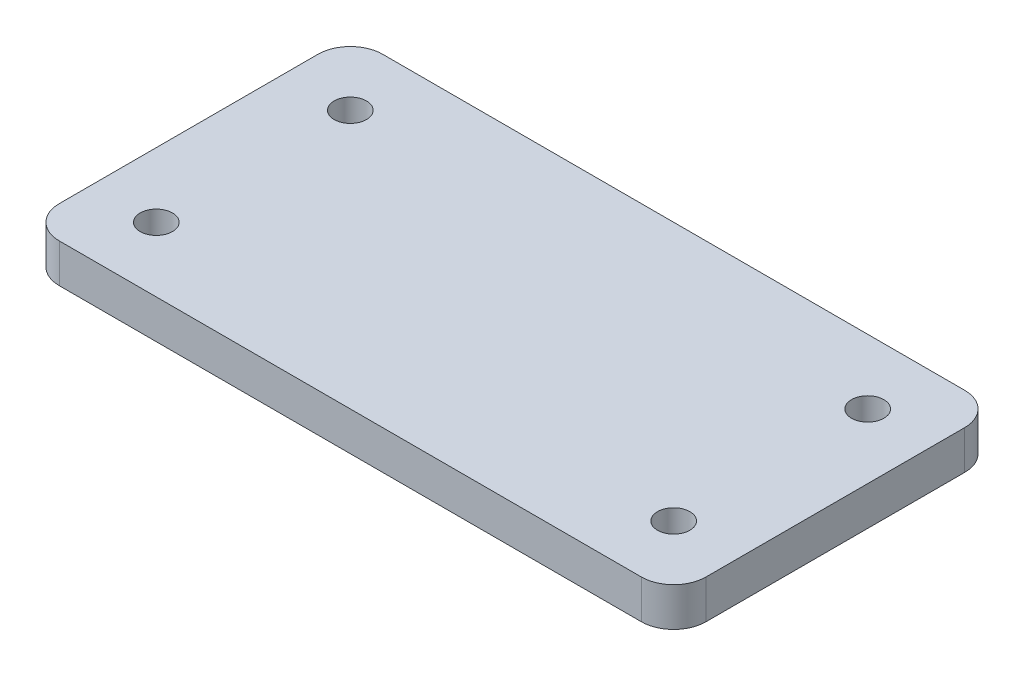
ISO-10303-21;
HEADER;
FILE_DESCRIPTION(('STEP AP214'),'2;1');
FILE_NAME('part.step','',(''),(''),'','','');
FILE_SCHEMA(('AUTOMOTIVE_DESIGN { 1 0 10303 214 1 1 1 1 }'));
ENDSEC;
DATA;
#1=APPLICATION_CONTEXT('core data for automotive mechanical design processes');
#2=APPLICATION_PROTOCOL_DEFINITION('international standard','automotive_design',2000,#1);
#3=PRODUCT_CONTEXT('',#1,'mechanical');
#4=PRODUCT('Part','Part','',(#3));
#5=PRODUCT_RELATED_PRODUCT_CATEGORY('part','',(#4));
#6=PRODUCT_DEFINITION_FORMATION('','',#4);
#7=PRODUCT_DEFINITION_CONTEXT('part definition',#1,'design');
#8=PRODUCT_DEFINITION('design','',#6,#7);
#9=PRODUCT_DEFINITION_SHAPE('','',#8);
#10=(LENGTH_UNIT() NAMED_UNIT(*) SI_UNIT(.MILLI.,.METRE.));
#11=(NAMED_UNIT(*) PLANE_ANGLE_UNIT() SI_UNIT($,.RADIAN.));
#12=(NAMED_UNIT(*) SI_UNIT($,.STERADIAN.) SOLID_ANGLE_UNIT());
#13=UNCERTAINTY_MEASURE_WITH_UNIT(LENGTH_MEASURE(1.E-05),#10,'distance_accuracy_value','');
#14=(GEOMETRIC_REPRESENTATION_CONTEXT(3) GLOBAL_UNCERTAINTY_ASSIGNED_CONTEXT((#13)) GLOBAL_UNIT_ASSIGNED_CONTEXT((#10,
#11,#12)) REPRESENTATION_CONTEXT('',''));
#15=CARTESIAN_POINT('',(0.,0.,0.));
#16=DIRECTION('',(0.,0.,1.));
#17=DIRECTION('',(1.,0.,0.));
#18=AXIS2_PLACEMENT_3D('',#15,#16,#17);
#19=CARTESIAN_POINT('',(90.,12.,40.));
#20=DIRECTION('',(0.,1.,0.));
#21=DIRECTION('',(0.,0.,1.));
#22=AXIS2_PLACEMENT_3D('',#19,#20,#21);
#23=PLANE('',#22);
#24=CARTESIAN_POINT('',(80.,12.,-30.));
#25=DIRECTION('',(0.,1.,0.));
#26=DIRECTION('',(0.,0.,1.));
#27=AXIS2_PLACEMENT_3D('',#24,#25,#26);
#28=CIRCLE('',#27,5.);
#29=CARTESIAN_POINT('',(80.,12.,-25.));
#30=VERTEX_POINT('',#29);
#31=EDGE_CURVE('E188',#30,#30,#28,.T.);
#32=ORIENTED_EDGE('',*,*,#31,.F.);
#33=EDGE_LOOP('',(#32));
#34=FACE_BOUND('',#33,.T.);
#35=CARTESIAN_POINT('',(-80.,12.,30.));
#36=DIRECTION('',(0.,1.,0.));
#37=DIRECTION('',(0.,0.,1.));
#38=AXIS2_PLACEMENT_3D('',#35,#36,#37);
#39=CIRCLE('',#38,4.99999999999999);
#40=CARTESIAN_POINT('',(-80.,12.,35.));
#41=VERTEX_POINT('',#40);
#42=EDGE_CURVE('E134',#41,#41,#39,.T.);
#43=ORIENTED_EDGE('',*,*,#42,.F.);
#44=EDGE_LOOP('',(#43));
#45=FACE_BOUND('',#44,.T.);
#46=CARTESIAN_POINT('',(90.,12.,40.));
#47=DIRECTION('',(0.,1.,0.));
#48=DIRECTION('',(0.,0.,1.));
#49=AXIS2_PLACEMENT_3D('',#46,#47,#48);
#50=CIRCLE('',#49,10.);
#51=CARTESIAN_POINT('',(90.,12.,50.));
#52=VERTEX_POINT('',#51);
#53=CARTESIAN_POINT('',(100.,12.,40.));
#54=VERTEX_POINT('',#53);
#55=EDGE_CURVE('E145',#52,#54,#50,.T.);
#56=ORIENTED_EDGE('',*,*,#55,.T.);
#57=DIRECTION('',(0.,0.,-1.));
#58=VECTOR('',#57,1.);
#59=CARTESIAN_POINT('',(100.,12.,40.));
#60=LINE('',#59,#58);
#61=CARTESIAN_POINT('',(100.,12.,-40.));
#62=VERTEX_POINT('',#61);
#63=EDGE_CURVE('E93',#54,#62,#60,.T.);
#64=ORIENTED_EDGE('',*,*,#63,.T.);
#65=CARTESIAN_POINT('',(90.,12.,-40.));
#66=DIRECTION('',(0.,1.,0.));
#67=DIRECTION('',(0.,0.,-1.));
#68=AXIS2_PLACEMENT_3D('',#65,#66,#67);
#69=CIRCLE('',#68,9.99999999999998);
#70=CARTESIAN_POINT('',(90.,12.,-50.));
#71=VERTEX_POINT('',#70);
#72=EDGE_CURVE('E160',#62,#71,#69,.T.);
#73=ORIENTED_EDGE('',*,*,#72,.T.);
#74=DIRECTION('',(-1.,0.,0.));
#75=VECTOR('',#74,1.);
#76=CARTESIAN_POINT('',(-90.,12.,-50.));
#77=LINE('',#76,#75);
#78=CARTESIAN_POINT('',(-90.,12.,-50.));
#79=VERTEX_POINT('',#78);
#80=EDGE_CURVE('E173',#71,#79,#77,.T.);
#81=ORIENTED_EDGE('',*,*,#80,.T.);
#82=CARTESIAN_POINT('',(-90.,12.,-40.));
#83=DIRECTION('',(0.,1.,0.));
#84=DIRECTION('',(0.,0.,-1.));
#85=AXIS2_PLACEMENT_3D('',#82,#83,#84);
#86=CIRCLE('',#85,10.);
#87=CARTESIAN_POINT('',(-100.,12.,-40.));
#88=VERTEX_POINT('',#87);
#89=EDGE_CURVE('E112',#79,#88,#86,.T.);
#90=ORIENTED_EDGE('',*,*,#89,.T.);
#91=DIRECTION('',(0.,0.,1.));
#92=VECTOR('',#91,1.);
#93=CARTESIAN_POINT('',(-100.,12.,40.));
#94=LINE('',#93,#92);
#95=CARTESIAN_POINT('',(-100.,12.,40.));
#96=VERTEX_POINT('',#95);
#97=EDGE_CURVE('E106',#88,#96,#94,.T.);
#98=ORIENTED_EDGE('',*,*,#97,.T.);
#99=CARTESIAN_POINT('',(-90.,12.,40.));
#100=DIRECTION('',(0.,1.,0.));
#101=DIRECTION('',(0.,0.,-1.));
#102=AXIS2_PLACEMENT_3D('',#99,#100,#101);
#103=CIRCLE('',#102,10.);
#104=CARTESIAN_POINT('',(-90.,12.,50.));
#105=VERTEX_POINT('',#104);
#106=EDGE_CURVE('E110',#96,#105,#103,.T.);
#107=ORIENTED_EDGE('',*,*,#106,.T.);
#108=DIRECTION('',(1.,0.,0.));
#109=VECTOR('',#108,1.);
#110=CARTESIAN_POINT('',(-90.,12.,50.));
#111=LINE('',#110,#109);
#112=EDGE_CURVE('E50',#105,#52,#111,.T.);
#113=ORIENTED_EDGE('',*,*,#112,.T.);
#114=EDGE_LOOP('',(#56,#64,#73,#81,#90,#98,#107,#113));
#115=FACE_BOUND('',#114,.T.);
#116=CARTESIAN_POINT('',(-80.,12.,-30.));
#117=DIRECTION('',(0.,1.,0.));
#118=DIRECTION('',(0.,0.,1.));
#119=AXIS2_PLACEMENT_3D('',#116,#117,#118);
#120=CIRCLE('',#119,4.99999999999999);
#121=CARTESIAN_POINT('',(-80.,12.,-25.));
#122=VERTEX_POINT('',#121);
#123=EDGE_CURVE('E182',#122,#122,#120,.T.);
#124=ORIENTED_EDGE('',*,*,#123,.F.);
#125=EDGE_LOOP('',(#124));
#126=FACE_BOUND('',#125,.T.);
#127=CARTESIAN_POINT('',(80.,12.,30.));
#128=DIRECTION('',(0.,1.,0.));
#129=DIRECTION('',(0.,0.,1.));
#130=AXIS2_PLACEMENT_3D('',#127,#128,#129);
#131=CIRCLE('',#130,5.);
#132=CARTESIAN_POINT('',(80.,12.,35.));
#133=VERTEX_POINT('',#132);
#134=EDGE_CURVE('E194',#133,#133,#131,.T.);
#135=ORIENTED_EDGE('',*,*,#134,.F.);
#136=EDGE_LOOP('',(#135));
#137=FACE_BOUND('',#136,.T.);
#138=ADVANCED_FACE('F33',(#34,#45,#115,#126,#137),#23,.T.);
#139=CARTESIAN_POINT('',(90.,0.,40.));
#140=DIRECTION('',(0.,1.,0.));
#141=DIRECTION('',(0.,0.,1.));
#142=AXIS2_PLACEMENT_3D('',#139,#140,#141);
#143=PLANE('',#142);
#144=CARTESIAN_POINT('',(80.,0.,-30.));
#145=DIRECTION('',(0.,1.,0.));
#146=DIRECTION('',(0.,0.,1.));
#147=AXIS2_PLACEMENT_3D('',#144,#145,#146);
#148=CIRCLE('',#147,5.);
#149=CARTESIAN_POINT('',(80.,0.,-25.));
#150=VERTEX_POINT('',#149);
#151=EDGE_CURVE('E191',#150,#150,#148,.T.);
#152=ORIENTED_EDGE('',*,*,#151,.T.);
#153=EDGE_LOOP('',(#152));
#154=FACE_BOUND('',#153,.T.);
#155=CARTESIAN_POINT('',(-80.,0.,30.));
#156=DIRECTION('',(0.,1.,0.));
#157=DIRECTION('',(0.,0.,1.));
#158=AXIS2_PLACEMENT_3D('',#155,#156,#157);
#159=CIRCLE('',#158,4.99999999999999);
#160=CARTESIAN_POINT('',(-80.,0.,35.));
#161=VERTEX_POINT('',#160);
#162=EDGE_CURVE('E179',#161,#161,#159,.T.);
#163=ORIENTED_EDGE('',*,*,#162,.T.);
#164=EDGE_LOOP('',(#163));
#165=FACE_BOUND('',#164,.T.);
#166=CARTESIAN_POINT('',(90.,0.,40.));
#167=DIRECTION('',(0.,1.,0.));
#168=DIRECTION('',(0.,0.,1.));
#169=AXIS2_PLACEMENT_3D('',#166,#167,#168);
#170=CIRCLE('',#169,10.);
#171=CARTESIAN_POINT('',(90.,0.,50.));
#172=VERTEX_POINT('',#171);
#173=CARTESIAN_POINT('',(100.,0.,40.));
#174=VERTEX_POINT('',#173);
#175=EDGE_CURVE('E130',#172,#174,#170,.T.);
#176=ORIENTED_EDGE('',*,*,#175,.F.);
#177=DIRECTION('',(1.,0.,0.));
#178=VECTOR('',#177,1.);
#179=CARTESIAN_POINT('',(-90.,0.,50.));
#180=LINE('',#179,#178);
#181=CARTESIAN_POINT('',(-90.,0.,50.));
#182=VERTEX_POINT('',#181);
#183=EDGE_CURVE('E85',#182,#172,#180,.T.);
#184=ORIENTED_EDGE('',*,*,#183,.F.);
#185=CARTESIAN_POINT('',(-90.,0.,40.));
#186=DIRECTION('',(0.,1.,0.));
#187=DIRECTION('',(0.,0.,-1.));
#188=AXIS2_PLACEMENT_3D('',#185,#186,#187);
#189=CIRCLE('',#188,10.);
#190=CARTESIAN_POINT('',(-100.,0.,40.));
#191=VERTEX_POINT('',#190);
#192=EDGE_CURVE('E79',#191,#182,#189,.T.);
#193=ORIENTED_EDGE('',*,*,#192,.F.);
#194=DIRECTION('',(0.,0.,1.));
#195=VECTOR('',#194,1.);
#196=CARTESIAN_POINT('',(-100.,0.,40.));
#197=LINE('',#196,#195);
#198=CARTESIAN_POINT('',(-100.,0.,-40.));
#199=VERTEX_POINT('',#198);
#200=EDGE_CURVE('E120',#199,#191,#197,.T.);
#201=ORIENTED_EDGE('',*,*,#200,.F.);
#202=CARTESIAN_POINT('',(-90.,0.,-40.));
#203=DIRECTION('',(0.,1.,0.));
#204=DIRECTION('',(0.,0.,-1.));
#205=AXIS2_PLACEMENT_3D('',#202,#203,#204);
#206=CIRCLE('',#205,10.);
#207=CARTESIAN_POINT('',(-90.,0.,-50.));
#208=VERTEX_POINT('',#207);
#209=EDGE_CURVE('E140',#208,#199,#206,.T.);
#210=ORIENTED_EDGE('',*,*,#209,.F.);
#211=DIRECTION('',(-1.,0.,0.));
#212=VECTOR('',#211,1.);
#213=CARTESIAN_POINT('',(-90.,0.,-50.));
#214=LINE('',#213,#212);
#215=CARTESIAN_POINT('',(90.,0.,-50.));
#216=VERTEX_POINT('',#215);
#217=EDGE_CURVE('E138',#216,#208,#214,.T.);
#218=ORIENTED_EDGE('',*,*,#217,.F.);
#219=CARTESIAN_POINT('',(90.,0.,-40.));
#220=DIRECTION('',(0.,1.,0.));
#221=DIRECTION('',(0.,0.,-1.));
#222=AXIS2_PLACEMENT_3D('',#219,#220,#221);
#223=CIRCLE('',#222,9.99999999999998);
#224=CARTESIAN_POINT('',(100.,0.,-40.));
#225=VERTEX_POINT('',#224);
#226=EDGE_CURVE('E136',#225,#216,#223,.T.);
#227=ORIENTED_EDGE('',*,*,#226,.F.);
#228=DIRECTION('',(0.,0.,-1.));
#229=VECTOR('',#228,1.);
#230=CARTESIAN_POINT('',(100.,0.,40.));
#231=LINE('',#230,#229);
#232=EDGE_CURVE('E133',#174,#225,#231,.T.);
#233=ORIENTED_EDGE('',*,*,#232,.F.);
#234=EDGE_LOOP('',(#176,#184,#193,#201,#210,#218,#227,#233));
#235=FACE_BOUND('',#234,.T.);
#236=CARTESIAN_POINT('',(-80.,0.,-30.));
#237=DIRECTION('',(0.,1.,0.));
#238=DIRECTION('',(0.,0.,1.));
#239=AXIS2_PLACEMENT_3D('',#236,#237,#238);
#240=CIRCLE('',#239,4.99999999999999);
#241=CARTESIAN_POINT('',(-80.,0.,-25.));
#242=VERTEX_POINT('',#241);
#243=EDGE_CURVE('E185',#242,#242,#240,.T.);
#244=ORIENTED_EDGE('',*,*,#243,.T.);
#245=EDGE_LOOP('',(#244));
#246=FACE_BOUND('',#245,.T.);
#247=CARTESIAN_POINT('',(80.,0.,30.));
#248=DIRECTION('',(0.,1.,0.));
#249=DIRECTION('',(0.,0.,1.));
#250=AXIS2_PLACEMENT_3D('',#247,#248,#249);
#251=CIRCLE('',#250,5.);
#252=CARTESIAN_POINT('',(80.,0.,35.));
#253=VERTEX_POINT('',#252);
#254=EDGE_CURVE('E197',#253,#253,#251,.T.);
#255=ORIENTED_EDGE('',*,*,#254,.T.);
#256=EDGE_LOOP('',(#255));
#257=FACE_BOUND('',#256,.T.);
#258=ADVANCED_FACE('F164',(#154,#165,#235,#246,#257),#143,.F.);
#259=CARTESIAN_POINT('',(90.,12.,40.));
#260=DIRECTION('',(0.,-1.,0.));
#261=DIRECTION('',(0.,0.,-1.));
#262=AXIS2_PLACEMENT_3D('',#259,#260,#261);
#263=CYLINDRICAL_SURFACE('',#262,10.);
#264=ORIENTED_EDGE('',*,*,#175,.T.);
#265=DIRECTION('',(0.,-1.,0.));
#266=VECTOR('',#265,1.);
#267=CARTESIAN_POINT('',(100.,12.,40.));
#268=LINE('',#267,#266);
#269=EDGE_CURVE('E11',#54,#174,#268,.T.);
#270=ORIENTED_EDGE('',*,*,#269,.F.);
#271=ORIENTED_EDGE('',*,*,#55,.F.);
#272=DIRECTION('',(0.,-1.,0.));
#273=VECTOR('',#272,1.);
#274=CARTESIAN_POINT('',(90.,12.,50.));
#275=LINE('',#274,#273);
#276=EDGE_CURVE('E126',#52,#172,#275,.T.);
#277=ORIENTED_EDGE('',*,*,#276,.T.);
#278=EDGE_LOOP('',(#264,#270,#271,#277));
#279=FACE_BOUND('',#278,.T.);
#280=ADVANCED_FACE('F35',(#279),#263,.T.);
#281=CARTESIAN_POINT('',(100.,12.,40.));
#282=DIRECTION('',(-1.,0.,0.));
#283=DIRECTION('',(0.,0.,1.));
#284=AXIS2_PLACEMENT_3D('',#281,#282,#283);
#285=PLANE('',#284);
#286=ORIENTED_EDGE('',*,*,#232,.T.);
#287=DIRECTION('',(0.,-1.,0.));
#288=VECTOR('',#287,1.);
#289=CARTESIAN_POINT('',(100.,12.,-40.));
#290=LINE('',#289,#288);
#291=EDGE_CURVE('E42',#62,#225,#290,.T.);
#292=ORIENTED_EDGE('',*,*,#291,.F.);
#293=ORIENTED_EDGE('',*,*,#63,.F.);
#294=ORIENTED_EDGE('',*,*,#269,.T.);
#295=EDGE_LOOP('',(#286,#292,#293,#294));
#296=FACE_BOUND('',#295,.T.);
#297=ADVANCED_FACE('F232',(#296),#285,.F.);
#298=CARTESIAN_POINT('',(90.,12.,-40.));
#299=DIRECTION('',(0.,-1.,0.));
#300=DIRECTION('',(0.,0.,-1.));
#301=AXIS2_PLACEMENT_3D('',#298,#299,#300);
#302=CYLINDRICAL_SURFACE('',#301,9.99999999999998);
#303=ORIENTED_EDGE('',*,*,#226,.T.);
#304=DIRECTION('',(0.,-1.,0.));
#305=VECTOR('',#304,1.);
#306=CARTESIAN_POINT('',(90.,12.,-50.));
#307=LINE('',#306,#305);
#308=EDGE_CURVE('E152',#71,#216,#307,.T.);
#309=ORIENTED_EDGE('',*,*,#308,.F.);
#310=ORIENTED_EDGE('',*,*,#72,.F.);
#311=ORIENTED_EDGE('',*,*,#291,.T.);
#312=EDGE_LOOP('',(#303,#309,#310,#311));
#313=FACE_BOUND('',#312,.T.);
#314=ADVANCED_FACE('F158',(#313),#302,.T.);
#315=CARTESIAN_POINT('',(-90.,12.,-50.));
#316=DIRECTION('',(0.,0.,1.));
#317=DIRECTION('',(1.,0.,0.));
#318=AXIS2_PLACEMENT_3D('',#315,#316,#317);
#319=PLANE('',#318);
#320=ORIENTED_EDGE('',*,*,#217,.T.);
#321=DIRECTION('',(0.,-1.,0.));
#322=VECTOR('',#321,1.);
#323=CARTESIAN_POINT('',(-90.,12.,-50.));
#324=LINE('',#323,#322);
#325=EDGE_CURVE('E149',#79,#208,#324,.T.);
#326=ORIENTED_EDGE('',*,*,#325,.F.);
#327=ORIENTED_EDGE('',*,*,#80,.F.);
#328=ORIENTED_EDGE('',*,*,#308,.T.);
#329=EDGE_LOOP('',(#320,#326,#327,#328));
#330=FACE_BOUND('',#329,.T.);
#331=ADVANCED_FACE('F169',(#330),#319,.F.);
#332=CARTESIAN_POINT('',(-90.,12.,-40.));
#333=DIRECTION('',(0.,-1.,0.));
#334=DIRECTION('',(0.,0.,-1.));
#335=AXIS2_PLACEMENT_3D('',#332,#333,#334);
#336=CYLINDRICAL_SURFACE('',#335,10.);
#337=ORIENTED_EDGE('',*,*,#209,.T.);
#338=DIRECTION('',(0.,-1.,0.));
#339=VECTOR('',#338,1.);
#340=CARTESIAN_POINT('',(-100.,12.,-40.));
#341=LINE('',#340,#339);
#342=EDGE_CURVE('E121',#88,#199,#341,.T.);
#343=ORIENTED_EDGE('',*,*,#342,.F.);
#344=ORIENTED_EDGE('',*,*,#89,.F.);
#345=ORIENTED_EDGE('',*,*,#325,.T.);
#346=EDGE_LOOP('',(#337,#343,#344,#345));
#347=FACE_BOUND('',#346,.T.);
#348=ADVANCED_FACE('F172',(#347),#336,.T.);
#349=CARTESIAN_POINT('',(-100.,12.,40.));
#350=DIRECTION('',(1.,0.,0.));
#351=DIRECTION('',(0.,0.,-1.));
#352=AXIS2_PLACEMENT_3D('',#349,#350,#351);
#353=PLANE('',#352);
#354=ORIENTED_EDGE('',*,*,#200,.T.);
#355=DIRECTION('',(0.,-1.,0.));
#356=VECTOR('',#355,1.);
#357=CARTESIAN_POINT('',(-100.,12.,40.));
#358=LINE('',#357,#356);
#359=EDGE_CURVE('E117',#96,#191,#358,.T.);
#360=ORIENTED_EDGE('',*,*,#359,.F.);
#361=ORIENTED_EDGE('',*,*,#97,.F.);
#362=ORIENTED_EDGE('',*,*,#342,.T.);
#363=EDGE_LOOP('',(#354,#360,#361,#362));
#364=FACE_BOUND('',#363,.T.);
#365=ADVANCED_FACE('F118',(#364),#353,.F.);
#366=CARTESIAN_POINT('',(-90.,12.,40.));
#367=DIRECTION('',(0.,-1.,0.));
#368=DIRECTION('',(0.,0.,-1.));
#369=AXIS2_PLACEMENT_3D('',#366,#367,#368);
#370=CYLINDRICAL_SURFACE('',#369,10.);
#371=ORIENTED_EDGE('',*,*,#192,.T.);
#372=DIRECTION('',(0.,-1.,0.));
#373=VECTOR('',#372,1.);
#374=CARTESIAN_POINT('',(-90.,12.,50.));
#375=LINE('',#374,#373);
#376=EDGE_CURVE('E122',#105,#182,#375,.T.);
#377=ORIENTED_EDGE('',*,*,#376,.F.);
#378=ORIENTED_EDGE('',*,*,#106,.F.);
#379=ORIENTED_EDGE('',*,*,#359,.T.);
#380=EDGE_LOOP('',(#371,#377,#378,#379));
#381=FACE_BOUND('',#380,.T.);
#382=ADVANCED_FACE('F124',(#381),#370,.T.);
#383=CARTESIAN_POINT('',(-90.,12.,50.));
#384=DIRECTION('',(0.,0.,-1.));
#385=DIRECTION('',(-1.,0.,0.));
#386=AXIS2_PLACEMENT_3D('',#383,#384,#385);
#387=PLANE('',#386);
#388=ORIENTED_EDGE('',*,*,#183,.T.);
#389=ORIENTED_EDGE('',*,*,#276,.F.);
#390=ORIENTED_EDGE('',*,*,#112,.F.);
#391=ORIENTED_EDGE('',*,*,#376,.T.);
#392=EDGE_LOOP('',(#388,#389,#390,#391));
#393=FACE_BOUND('',#392,.T.);
#394=ADVANCED_FACE('F220',(#393),#387,.F.);
#395=CARTESIAN_POINT('',(-80.,12.,30.));
#396=DIRECTION('',(0.,-1.,0.));
#397=DIRECTION('',(0.,0.,-1.));
#398=AXIS2_PLACEMENT_3D('',#395,#396,#397);
#399=CYLINDRICAL_SURFACE('',#398,4.99999999999999);
#400=ORIENTED_EDGE('',*,*,#42,.T.);
#401=EDGE_LOOP('',(#400));
#402=FACE_BOUND('',#401,.T.);
#403=ORIENTED_EDGE('',*,*,#162,.F.);
#404=EDGE_LOOP('',(#403));
#405=FACE_BOUND('',#404,.T.);
#406=ADVANCED_FACE('F217',(#402,#405),#399,.F.);
#407=CARTESIAN_POINT('',(-80.,12.,-30.));
#408=DIRECTION('',(0.,-1.,0.));
#409=DIRECTION('',(0.,0.,-1.));
#410=AXIS2_PLACEMENT_3D('',#407,#408,#409);
#411=CYLINDRICAL_SURFACE('',#410,4.99999999999999);
#412=ORIENTED_EDGE('',*,*,#123,.T.);
#413=EDGE_LOOP('',(#412));
#414=FACE_BOUND('',#413,.T.);
#415=ORIENTED_EDGE('',*,*,#243,.F.);
#416=EDGE_LOOP('',(#415));
#417=FACE_BOUND('',#416,.T.);
#418=ADVANCED_FACE('F296',(#414,#417),#411,.F.);
#419=CARTESIAN_POINT('',(80.,12.,-30.));
#420=DIRECTION('',(0.,-1.,0.));
#421=DIRECTION('',(0.,0.,-1.));
#422=AXIS2_PLACEMENT_3D('',#419,#420,#421);
#423=CYLINDRICAL_SURFACE('',#422,5.);
#424=ORIENTED_EDGE('',*,*,#31,.T.);
#425=EDGE_LOOP('',(#424));
#426=FACE_BOUND('',#425,.T.);
#427=ORIENTED_EDGE('',*,*,#151,.F.);
#428=EDGE_LOOP('',(#427));
#429=FACE_BOUND('',#428,.T.);
#430=ADVANCED_FACE('F304',(#426,#429),#423,.F.);
#431=CARTESIAN_POINT('',(80.,12.,30.));
#432=DIRECTION('',(0.,-1.,0.));
#433=DIRECTION('',(0.,0.,-1.));
#434=AXIS2_PLACEMENT_3D('',#431,#432,#433);
#435=CYLINDRICAL_SURFACE('',#434,5.);
#436=ORIENTED_EDGE('',*,*,#134,.T.);
#437=EDGE_LOOP('',(#436));
#438=FACE_BOUND('',#437,.T.);
#439=ORIENTED_EDGE('',*,*,#254,.F.);
#440=EDGE_LOOP('',(#439));
#441=FACE_BOUND('',#440,.T.);
#442=ADVANCED_FACE('F203',(#438,#441),#435,.F.);
#443=CLOSED_SHELL('',(#138,#258,#280,#297,#314,#331,#348,#365,#382,#394,#406,#418,#430,#442));
#444=MANIFOLD_SOLID_BREP('B2',#443);
#445=ADVANCED_BREP_SHAPE_REPRESENTATION('',(#18,#444),#14);
#446=SHAPE_DEFINITION_REPRESENTATION(#9,#445);
ENDSEC;
END-ISO-10303-21;
